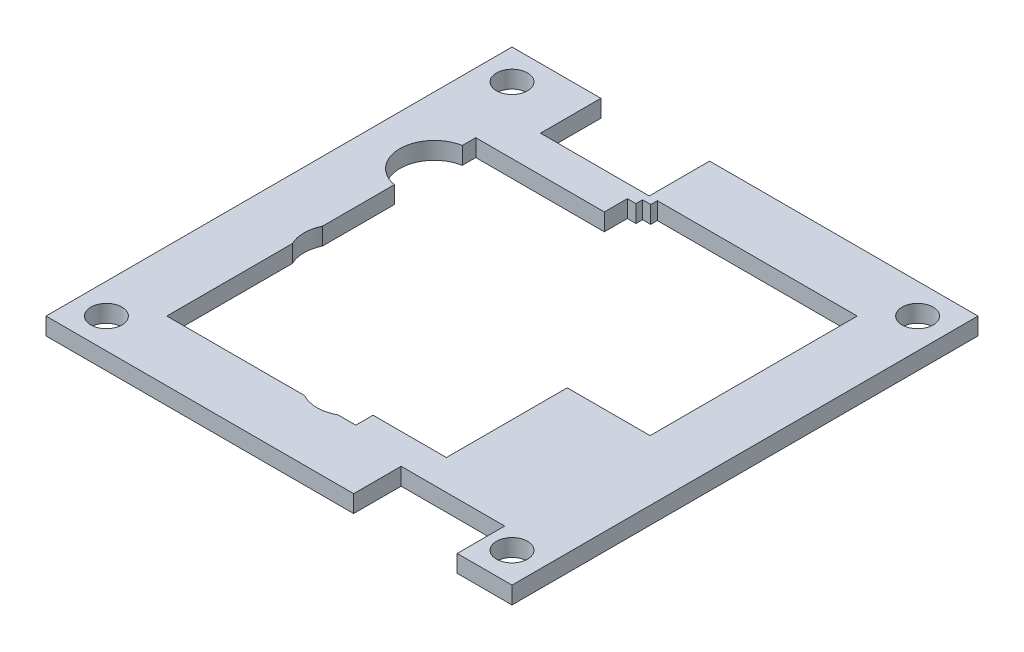
ISO-10303-21;
HEADER;
FILE_DESCRIPTION(('STEP AP214'),'2;1');
FILE_NAME('part.step','',(''),(''),'','','');
FILE_SCHEMA(('AUTOMOTIVE_DESIGN { 1 0 10303 214 1 1 1 1 }'));
ENDSEC;
DATA;
#1=APPLICATION_CONTEXT('core data for automotive mechanical design processes');
#2=APPLICATION_PROTOCOL_DEFINITION('international standard','automotive_design',2000,#1);
#3=PRODUCT_CONTEXT('',#1,'mechanical');
#4=PRODUCT('Part','Part','',(#3));
#5=PRODUCT_RELATED_PRODUCT_CATEGORY('part','',(#4));
#6=PRODUCT_DEFINITION_FORMATION('','',#4);
#7=PRODUCT_DEFINITION_CONTEXT('part definition',#1,'design');
#8=PRODUCT_DEFINITION('design','',#6,#7);
#9=PRODUCT_DEFINITION_SHAPE('','',#8);
#10=(LENGTH_UNIT() NAMED_UNIT(*) SI_UNIT(.MILLI.,.METRE.));
#11=(NAMED_UNIT(*) PLANE_ANGLE_UNIT() SI_UNIT($,.RADIAN.));
#12=(NAMED_UNIT(*) SI_UNIT($,.STERADIAN.) SOLID_ANGLE_UNIT());
#13=UNCERTAINTY_MEASURE_WITH_UNIT(LENGTH_MEASURE(1.E-05),#10,'distance_accuracy_value','');
#14=(GEOMETRIC_REPRESENTATION_CONTEXT(3) GLOBAL_UNCERTAINTY_ASSIGNED_CONTEXT((#13)) GLOBAL_UNIT_ASSIGNED_CONTEXT((#10,
#11,#12)) REPRESENTATION_CONTEXT('',''));
#15=CARTESIAN_POINT('',(0.,0.,0.));
#16=DIRECTION('',(0.,0.,1.));
#17=DIRECTION('',(1.,0.,0.));
#18=AXIS2_PLACEMENT_3D('',#15,#16,#17);
#19=CARTESIAN_POINT('',(0.,2.,-20.));
#20=DIRECTION('',(0.,0.,-1.));
#21=DIRECTION('',(-1.,0.,0.));
#22=AXIS2_PLACEMENT_3D('',#19,#20,#21);
#23=PLANE('',#22);
#24=DIRECTION('',(1.,0.,0.));
#25=VECTOR('',#24,1.);
#26=CARTESIAN_POINT('',(0.,0.,-20.));
#27=LINE('',#26,#25);
#28=CARTESIAN_POINT('',(-16.7,0.,-20.));
#29=VERTEX_POINT('',#28);
#30=CARTESIAN_POINT('',(-4.1,0.,-20.));
#31=VERTEX_POINT('',#30);
#32=EDGE_CURVE('E391',#29,#31,#27,.T.);
#33=ORIENTED_EDGE('',*,*,#32,.F.);
#34=DIRECTION('',(0.,-1.,0.));
#35=VECTOR('',#34,1.);
#36=CARTESIAN_POINT('',(-16.7,2.,-20.));
#37=LINE('',#36,#35);
#38=CARTESIAN_POINT('',(-16.7,2.,-20.));
#39=VERTEX_POINT('',#38);
#40=EDGE_CURVE('E11',#39,#29,#37,.T.);
#41=ORIENTED_EDGE('',*,*,#40,.F.);
#42=DIRECTION('',(1.,0.,0.));
#43=VECTOR('',#42,1.);
#44=CARTESIAN_POINT('',(0.,2.,-20.));
#45=LINE('',#44,#43);
#46=CARTESIAN_POINT('',(-4.1,2.,-20.));
#47=VERTEX_POINT('',#46);
#48=EDGE_CURVE('E473',#39,#47,#45,.T.);
#49=ORIENTED_EDGE('',*,*,#48,.T.);
#50=DIRECTION('',(0.,-1.,0.));
#51=VECTOR('',#50,1.);
#52=CARTESIAN_POINT('',(-4.1,2.,-20.));
#53=LINE('',#52,#51);
#54=EDGE_CURVE('E54',#47,#31,#53,.T.);
#55=ORIENTED_EDGE('',*,*,#54,.T.);
#56=EDGE_LOOP('',(#33,#41,#49,#55));
#57=FACE_BOUND('',#56,.T.);
#58=ADVANCED_FACE('F35',(#57),#23,.T.);
#59=CARTESIAN_POINT('',(-16.7,2.,0.));
#60=DIRECTION('',(-1.,0.,0.));
#61=DIRECTION('',(0.,0.,1.));
#62=AXIS2_PLACEMENT_3D('',#59,#60,#61);
#63=PLANE('',#62);
#64=DIRECTION('',(0.,0.,-1.));
#65=VECTOR('',#64,1.);
#66=CARTESIAN_POINT('',(-16.7,0.,0.));
#67=LINE('',#66,#65);
#68=CARTESIAN_POINT('',(-16.7,0.,-27.));
#69=VERTEX_POINT('',#68);
#70=EDGE_CURVE('E388',#29,#69,#67,.T.);
#71=ORIENTED_EDGE('',*,*,#70,.T.);
#72=DIRECTION('',(0.,-1.,0.));
#73=VECTOR('',#72,1.);
#74=CARTESIAN_POINT('',(-16.7,2.,-27.));
#75=LINE('',#74,#73);
#76=CARTESIAN_POINT('',(-16.7,2.,-27.));
#77=VERTEX_POINT('',#76);
#78=EDGE_CURVE('E45',#77,#69,#75,.T.);
#79=ORIENTED_EDGE('',*,*,#78,.F.);
#80=DIRECTION('',(0.,0.,-1.));
#81=VECTOR('',#80,1.);
#82=CARTESIAN_POINT('',(-16.7,2.,0.));
#83=LINE('',#82,#81);
#84=EDGE_CURVE('E470',#39,#77,#83,.T.);
#85=ORIENTED_EDGE('',*,*,#84,.F.);
#86=ORIENTED_EDGE('',*,*,#40,.T.);
#87=EDGE_LOOP('',(#71,#79,#85,#86));
#88=FACE_BOUND('',#87,.T.);
#89=ADVANCED_FACE('F570',(#88),#63,.F.);
#90=CARTESIAN_POINT('',(0.,2.,-27.));
#91=DIRECTION('',(0.,0.,1.));
#92=DIRECTION('',(1.,0.,0.));
#93=AXIS2_PLACEMENT_3D('',#90,#91,#92);
#94=PLANE('',#93);
#95=DIRECTION('',(-1.,0.,0.));
#96=VECTOR('',#95,1.);
#97=CARTESIAN_POINT('',(0.,0.,-27.));
#98=LINE('',#97,#96);
#99=CARTESIAN_POINT('',(-27.,0.,-27.));
#100=VERTEX_POINT('',#99);
#101=EDGE_CURVE('E385',#69,#100,#98,.T.);
#102=ORIENTED_EDGE('',*,*,#101,.T.);
#103=DIRECTION('',(0.,-1.,0.));
#104=VECTOR('',#103,1.);
#105=CARTESIAN_POINT('',(-27.,2.,-27.));
#106=LINE('',#105,#104);
#107=CARTESIAN_POINT('',(-27.,2.,-27.));
#108=VERTEX_POINT('',#107);
#109=EDGE_CURVE('E293',#108,#100,#106,.T.);
#110=ORIENTED_EDGE('',*,*,#109,.F.);
#111=DIRECTION('',(-1.,0.,0.));
#112=VECTOR('',#111,1.);
#113=CARTESIAN_POINT('',(0.,2.,-27.));
#114=LINE('',#113,#112);
#115=EDGE_CURVE('E467',#77,#108,#114,.T.);
#116=ORIENTED_EDGE('',*,*,#115,.F.);
#117=ORIENTED_EDGE('',*,*,#78,.T.);
#118=EDGE_LOOP('',(#102,#110,#116,#117));
#119=FACE_BOUND('',#118,.T.);
#120=ADVANCED_FACE('F575',(#119),#94,.F.);
#121=CARTESIAN_POINT('',(-27.,2.,0.));
#122=DIRECTION('',(1.,0.,0.));
#123=DIRECTION('',(0.,0.,-1.));
#124=AXIS2_PLACEMENT_3D('',#121,#122,#123);
#125=PLANE('',#124);
#126=DIRECTION('',(0.,0.,1.));
#127=VECTOR('',#126,1.);
#128=CARTESIAN_POINT('',(-27.,0.,0.));
#129=LINE('',#128,#127);
#130=CARTESIAN_POINT('',(-27.,0.,27.));
#131=VERTEX_POINT('',#130);
#132=EDGE_CURVE('E382',#100,#131,#129,.T.);
#133=ORIENTED_EDGE('',*,*,#132,.T.);
#134=DIRECTION('',(0.,-1.,0.));
#135=VECTOR('',#134,1.);
#136=CARTESIAN_POINT('',(-27.,2.,27.));
#137=LINE('',#136,#135);
#138=CARTESIAN_POINT('',(-27.,2.,27.));
#139=VERTEX_POINT('',#138);
#140=EDGE_CURVE('E290',#139,#131,#137,.T.);
#141=ORIENTED_EDGE('',*,*,#140,.F.);
#142=DIRECTION('',(0.,0.,1.));
#143=VECTOR('',#142,1.);
#144=CARTESIAN_POINT('',(-27.,2.,0.));
#145=LINE('',#144,#143);
#146=EDGE_CURVE('E464',#108,#139,#145,.T.);
#147=ORIENTED_EDGE('',*,*,#146,.F.);
#148=ORIENTED_EDGE('',*,*,#109,.T.);
#149=EDGE_LOOP('',(#133,#141,#147,#148));
#150=FACE_BOUND('',#149,.T.);
#151=ADVANCED_FACE('F725',(#150),#125,.F.);
#152=CARTESIAN_POINT('',(0.,2.,27.));
#153=DIRECTION('',(0.,0.,-1.));
#154=DIRECTION('',(-1.,0.,0.));
#155=AXIS2_PLACEMENT_3D('',#152,#153,#154);
#156=PLANE('',#155);
#157=DIRECTION('',(1.,0.,0.));
#158=VECTOR('',#157,1.);
#159=CARTESIAN_POINT('',(0.,0.,27.));
#160=LINE('',#159,#158);
#161=CARTESIAN_POINT('',(8.65,0.,27.));
#162=VERTEX_POINT('',#161);
#163=EDGE_CURVE('E379',#131,#162,#160,.T.);
#164=ORIENTED_EDGE('',*,*,#163,.T.);
#165=DIRECTION('',(0.,-1.,0.));
#166=VECTOR('',#165,1.);
#167=CARTESIAN_POINT('',(8.65,2.,27.));
#168=LINE('',#167,#166);
#169=CARTESIAN_POINT('',(8.65,2.,27.));
#170=VERTEX_POINT('',#169);
#171=EDGE_CURVE('E288',#170,#162,#168,.T.);
#172=ORIENTED_EDGE('',*,*,#171,.F.);
#173=DIRECTION('',(1.,0.,0.));
#174=VECTOR('',#173,1.);
#175=CARTESIAN_POINT('',(0.,2.,27.));
#176=LINE('',#175,#174);
#177=EDGE_CURVE('E462',#139,#170,#176,.T.);
#178=ORIENTED_EDGE('',*,*,#177,.F.);
#179=ORIENTED_EDGE('',*,*,#140,.T.);
#180=EDGE_LOOP('',(#164,#172,#178,#179));
#181=FACE_BOUND('',#180,.T.);
#182=ADVANCED_FACE('F717',(#181),#156,.F.);
#183=CARTESIAN_POINT('',(8.65,2.,0.));
#184=DIRECTION('',(1.,0.,0.));
#185=DIRECTION('',(0.,0.,-1.));
#186=AXIS2_PLACEMENT_3D('',#183,#184,#185);
#187=PLANE('',#186);
#188=DIRECTION('',(0.,0.,1.));
#189=VECTOR('',#188,1.);
#190=CARTESIAN_POINT('',(8.65,0.,0.));
#191=LINE('',#190,#189);
#192=CARTESIAN_POINT('',(8.65,0.,21.5));
#193=VERTEX_POINT('',#192);
#194=EDGE_CURVE('E376',#193,#162,#191,.T.);
#195=ORIENTED_EDGE('',*,*,#194,.F.);
#196=DIRECTION('',(0.,-1.,0.));
#197=VECTOR('',#196,1.);
#198=CARTESIAN_POINT('',(8.65,2.,21.5));
#199=LINE('',#198,#197);
#200=CARTESIAN_POINT('',(8.65,2.,21.5));
#201=VERTEX_POINT('',#200);
#202=EDGE_CURVE('E286',#201,#193,#199,.T.);
#203=ORIENTED_EDGE('',*,*,#202,.F.);
#204=DIRECTION('',(0.,0.,1.));
#205=VECTOR('',#204,1.);
#206=CARTESIAN_POINT('',(8.65,2.,0.));
#207=LINE('',#206,#205);
#208=EDGE_CURVE('E459',#201,#170,#207,.T.);
#209=ORIENTED_EDGE('',*,*,#208,.T.);
#210=ORIENTED_EDGE('',*,*,#171,.T.);
#211=EDGE_LOOP('',(#195,#203,#209,#210));
#212=FACE_BOUND('',#211,.T.);
#213=ADVANCED_FACE('F709',(#212),#187,.T.);
#214=CARTESIAN_POINT('',(0.,2.,21.5));
#215=DIRECTION('',(0.,0.,-1.));
#216=DIRECTION('',(-1.,0.,0.));
#217=AXIS2_PLACEMENT_3D('',#214,#215,#216);
#218=PLANE('',#217);
#219=DIRECTION('',(1.,0.,0.));
#220=VECTOR('',#219,1.);
#221=CARTESIAN_POINT('',(0.,0.,21.5));
#222=LINE('',#221,#220);
#223=CARTESIAN_POINT('',(20.65,0.,21.5));
#224=VERTEX_POINT('',#223);
#225=EDGE_CURVE('E373',#193,#224,#222,.T.);
#226=ORIENTED_EDGE('',*,*,#225,.T.);
#227=DIRECTION('',(0.,-1.,0.));
#228=VECTOR('',#227,1.);
#229=CARTESIAN_POINT('',(20.65,2.,21.5));
#230=LINE('',#229,#228);
#231=CARTESIAN_POINT('',(20.65,2.,21.5));
#232=VERTEX_POINT('',#231);
#233=EDGE_CURVE('E283',#232,#224,#230,.T.);
#234=ORIENTED_EDGE('',*,*,#233,.F.);
#235=DIRECTION('',(1.,0.,0.));
#236=VECTOR('',#235,1.);
#237=CARTESIAN_POINT('',(0.,2.,21.5));
#238=LINE('',#237,#236);
#239=EDGE_CURVE('E456',#201,#232,#238,.T.);
#240=ORIENTED_EDGE('',*,*,#239,.F.);
#241=ORIENTED_EDGE('',*,*,#202,.T.);
#242=EDGE_LOOP('',(#226,#234,#240,#241));
#243=FACE_BOUND('',#242,.T.);
#244=ADVANCED_FACE('F701',(#243),#218,.F.);
#245=CARTESIAN_POINT('',(20.65,2.,0.));
#246=DIRECTION('',(1.,0.,0.));
#247=DIRECTION('',(0.,0.,-1.));
#248=AXIS2_PLACEMENT_3D('',#245,#246,#247);
#249=PLANE('',#248);
#250=DIRECTION('',(0.,0.,1.));
#251=VECTOR('',#250,1.);
#252=CARTESIAN_POINT('',(20.65,0.,0.));
#253=LINE('',#252,#251);
#254=CARTESIAN_POINT('',(20.65,0.,27.));
#255=VERTEX_POINT('',#254);
#256=EDGE_CURVE('E370',#224,#255,#253,.T.);
#257=ORIENTED_EDGE('',*,*,#256,.T.);
#258=DIRECTION('',(0.,-1.,0.));
#259=VECTOR('',#258,1.);
#260=CARTESIAN_POINT('',(20.65,2.,27.));
#261=LINE('',#260,#259);
#262=CARTESIAN_POINT('',(20.65,2.,27.));
#263=VERTEX_POINT('',#262);
#264=EDGE_CURVE('E276',#263,#255,#261,.T.);
#265=ORIENTED_EDGE('',*,*,#264,.F.);
#266=DIRECTION('',(0.,0.,1.));
#267=VECTOR('',#266,1.);
#268=CARTESIAN_POINT('',(20.65,2.,0.));
#269=LINE('',#268,#267);
#270=EDGE_CURVE('E454',#232,#263,#269,.T.);
#271=ORIENTED_EDGE('',*,*,#270,.F.);
#272=ORIENTED_EDGE('',*,*,#233,.T.);
#273=EDGE_LOOP('',(#257,#265,#271,#272));
#274=FACE_BOUND('',#273,.T.);
#275=ADVANCED_FACE('F693',(#274),#249,.F.);
#276=CARTESIAN_POINT('',(0.,2.,27.));
#277=DIRECTION('',(0.,0.,-1.));
#278=DIRECTION('',(-1.,0.,0.));
#279=AXIS2_PLACEMENT_3D('',#276,#277,#278);
#280=PLANE('',#279);
#281=DIRECTION('',(1.,0.,0.));
#282=VECTOR('',#281,1.);
#283=CARTESIAN_POINT('',(0.,0.,27.));
#284=LINE('',#283,#282);
#285=CARTESIAN_POINT('',(27.,0.,27.));
#286=VERTEX_POINT('',#285);
#287=EDGE_CURVE('E367',#255,#286,#284,.T.);
#288=ORIENTED_EDGE('',*,*,#287,.T.);
#289=DIRECTION('',(0.,-1.,0.));
#290=VECTOR('',#289,1.);
#291=CARTESIAN_POINT('',(27.,2.,27.));
#292=LINE('',#291,#290);
#293=CARTESIAN_POINT('',(27.,2.,27.));
#294=VERTEX_POINT('',#293);
#295=EDGE_CURVE('E274',#294,#286,#292,.T.);
#296=ORIENTED_EDGE('',*,*,#295,.F.);
#297=DIRECTION('',(1.,0.,0.));
#298=VECTOR('',#297,1.);
#299=CARTESIAN_POINT('',(0.,2.,27.));
#300=LINE('',#299,#298);
#301=EDGE_CURVE('E267',#263,#294,#300,.T.);
#302=ORIENTED_EDGE('',*,*,#301,.F.);
#303=ORIENTED_EDGE('',*,*,#264,.T.);
#304=EDGE_LOOP('',(#288,#296,#302,#303));
#305=FACE_BOUND('',#304,.T.);
#306=ADVANCED_FACE('F686',(#305),#280,.F.);
#307=CARTESIAN_POINT('',(27.,2.,0.));
#308=DIRECTION('',(-1.,0.,0.));
#309=DIRECTION('',(0.,0.,1.));
#310=AXIS2_PLACEMENT_3D('',#307,#308,#309);
#311=PLANE('',#310);
#312=DIRECTION('',(0.,0.,-1.));
#313=VECTOR('',#312,1.);
#314=CARTESIAN_POINT('',(27.,0.,0.));
#315=LINE('',#314,#313);
#316=CARTESIAN_POINT('',(27.,0.,-27.));
#317=VERTEX_POINT('',#316);
#318=EDGE_CURVE('E273',#286,#317,#315,.T.);
#319=ORIENTED_EDGE('',*,*,#318,.T.);
#320=DIRECTION('',(0.,-1.,0.));
#321=VECTOR('',#320,1.);
#322=CARTESIAN_POINT('',(27.,2.,-27.));
#323=LINE('',#322,#321);
#324=CARTESIAN_POINT('',(27.,2.,-27.));
#325=VERTEX_POINT('',#324);
#326=EDGE_CURVE('E255',#325,#317,#323,.T.);
#327=ORIENTED_EDGE('',*,*,#326,.F.);
#328=DIRECTION('',(0.,0.,-1.));
#329=VECTOR('',#328,1.);
#330=CARTESIAN_POINT('',(27.,2.,0.));
#331=LINE('',#330,#329);
#332=EDGE_CURVE('E260',#294,#325,#331,.T.);
#333=ORIENTED_EDGE('',*,*,#332,.F.);
#334=ORIENTED_EDGE('',*,*,#295,.T.);
#335=EDGE_LOOP('',(#319,#327,#333,#334));
#336=FACE_BOUND('',#335,.T.);
#337=ADVANCED_FACE('F272',(#336),#311,.F.);
#338=CARTESIAN_POINT('',(0.,2.,-27.));
#339=DIRECTION('',(0.,0.,1.));
#340=DIRECTION('',(1.,0.,0.));
#341=AXIS2_PLACEMENT_3D('',#338,#339,#340);
#342=PLANE('',#341);
#343=DIRECTION('',(-1.,0.,0.));
#344=VECTOR('',#343,1.);
#345=CARTESIAN_POINT('',(0.,0.,-27.));
#346=LINE('',#345,#344);
#347=CARTESIAN_POINT('',(-4.1,0.,-27.));
#348=VERTEX_POINT('',#347);
#349=EDGE_CURVE('E364',#317,#348,#346,.T.);
#350=ORIENTED_EDGE('',*,*,#349,.T.);
#351=DIRECTION('',(0.,-1.,0.));
#352=VECTOR('',#351,1.);
#353=CARTESIAN_POINT('',(-4.1,2.,-27.));
#354=LINE('',#353,#352);
#355=CARTESIAN_POINT('',(-4.1,2.,-27.));
#356=VERTEX_POINT('',#355);
#357=EDGE_CURVE('E152',#356,#348,#354,.T.);
#358=ORIENTED_EDGE('',*,*,#357,.F.);
#359=DIRECTION('',(-1.,0.,0.));
#360=VECTOR('',#359,1.);
#361=CARTESIAN_POINT('',(0.,2.,-27.));
#362=LINE('',#361,#360);
#363=EDGE_CURVE('E251',#325,#356,#362,.T.);
#364=ORIENTED_EDGE('',*,*,#363,.F.);
#365=ORIENTED_EDGE('',*,*,#326,.T.);
#366=EDGE_LOOP('',(#350,#358,#364,#365));
#367=FACE_BOUND('',#366,.T.);
#368=ADVANCED_FACE('F253',(#367),#342,.F.);
#369=CARTESIAN_POINT('',(-20.,2.,0.));
#370=DIRECTION('',(1.,0.,0.));
#371=DIRECTION('',(0.,0.,-1.));
#372=AXIS2_PLACEMENT_3D('',#369,#370,#371);
#373=PLANE('',#372);
#374=DIRECTION('',(0.,0.,1.));
#375=VECTOR('',#374,1.);
#376=CARTESIAN_POINT('',(-20.,0.,0.));
#377=LINE('',#376,#375);
#378=CARTESIAN_POINT('',(-20.,0.,-15.8));
#379=VERTEX_POINT('',#378);
#380=CARTESIAN_POINT('',(-20.,0.,-14.238273733503));
#381=VERTEX_POINT('',#380);
#382=EDGE_CURVE('E438',#379,#381,#377,.T.);
#383=ORIENTED_EDGE('',*,*,#382,.F.);
#384=DIRECTION('',(0.,-1.,0.));
#385=VECTOR('',#384,1.);
#386=CARTESIAN_POINT('',(-20.,2.,-15.8));
#387=LINE('',#386,#385);
#388=CARTESIAN_POINT('',(-20.,2.,-15.8));
#389=VERTEX_POINT('',#388);
#390=EDGE_CURVE('E39',#389,#379,#387,.T.);
#391=ORIENTED_EDGE('',*,*,#390,.F.);
#392=DIRECTION('',(0.,0.,1.));
#393=VECTOR('',#392,1.);
#394=CARTESIAN_POINT('',(-20.,2.,0.));
#395=LINE('',#394,#393);
#396=CARTESIAN_POINT('',(-20.,2.,-14.238273733503));
#397=VERTEX_POINT('',#396);
#398=EDGE_CURVE('E351',#389,#397,#395,.T.);
#399=ORIENTED_EDGE('',*,*,#398,.T.);
#400=DIRECTION('',(0.,-1.,0.));
#401=VECTOR('',#400,1.);
#402=CARTESIAN_POINT('',(-20.,2.,-14.238273733503));
#403=LINE('',#402,#401);
#404=EDGE_CURVE('E298',#397,#381,#403,.T.);
#405=ORIENTED_EDGE('',*,*,#404,.T.);
#406=EDGE_LOOP('',(#383,#391,#399,#405));
#407=FACE_BOUND('',#406,.T.);
#408=ADVANCED_FACE('F557',(#407),#373,.T.);
#409=CARTESIAN_POINT('',(0.,2.,-15.8));
#410=DIRECTION('',(0.,0.,-1.));
#411=DIRECTION('',(-1.,0.,0.));
#412=AXIS2_PLACEMENT_3D('',#409,#410,#411);
#413=PLANE('',#412);
#414=DIRECTION('',(1.,0.,0.));
#415=VECTOR('',#414,1.);
#416=CARTESIAN_POINT('',(0.,0.,-15.8));
#417=LINE('',#416,#415);
#418=CARTESIAN_POINT('',(-5.1,0.,-15.8));
#419=VERTEX_POINT('',#418);
#420=EDGE_CURVE('E436',#379,#419,#417,.T.);
#421=ORIENTED_EDGE('',*,*,#420,.T.);
#422=DIRECTION('',(0.,-1.,0.));
#423=VECTOR('',#422,1.);
#424=CARTESIAN_POINT('',(-5.1,2.,-15.8));
#425=LINE('',#424,#423);
#426=CARTESIAN_POINT('',(-5.1,2.,-15.8));
#427=VERTEX_POINT('',#426);
#428=EDGE_CURVE('E339',#427,#419,#425,.T.);
#429=ORIENTED_EDGE('',*,*,#428,.F.);
#430=DIRECTION('',(1.,0.,0.));
#431=VECTOR('',#430,1.);
#432=CARTESIAN_POINT('',(0.,2.,-15.8));
#433=LINE('',#432,#431);
#434=EDGE_CURVE('E517',#389,#427,#433,.T.);
#435=ORIENTED_EDGE('',*,*,#434,.F.);
#436=ORIENTED_EDGE('',*,*,#390,.T.);
#437=EDGE_LOOP('',(#421,#429,#435,#436));
#438=FACE_BOUND('',#437,.T.);
#439=ADVANCED_FACE('F37',(#438),#413,.F.);
#440=CARTESIAN_POINT('',(-5.1,2.,0.));
#441=DIRECTION('',(-1.,0.,0.));
#442=DIRECTION('',(0.,0.,1.));
#443=AXIS2_PLACEMENT_3D('',#440,#441,#442);
#444=PLANE('',#443);
#445=DIRECTION('',(0.,0.,-1.));
#446=VECTOR('',#445,1.);
#447=CARTESIAN_POINT('',(-5.1,0.,0.));
#448=LINE('',#447,#446);
#449=CARTESIAN_POINT('',(-5.1,0.,-18.4633439008393));
#450=VERTEX_POINT('',#449);
#451=EDGE_CURVE('E434',#419,#450,#448,.T.);
#452=ORIENTED_EDGE('',*,*,#451,.T.);
#453=DIRECTION('',(0.,-1.,0.));
#454=VECTOR('',#453,1.);
#455=CARTESIAN_POINT('',(-5.1,2.,-18.4633439008393));
#456=LINE('',#455,#454);
#457=CARTESIAN_POINT('',(-5.1,2.,-18.4633439008393));
#458=VERTEX_POINT('',#457);
#459=EDGE_CURVE('E337',#458,#450,#456,.T.);
#460=ORIENTED_EDGE('',*,*,#459,.F.);
#461=DIRECTION('',(0.,0.,-1.));
#462=VECTOR('',#461,1.);
#463=CARTESIAN_POINT('',(-5.1,2.,0.));
#464=LINE('',#463,#462);
#465=EDGE_CURVE('E515',#427,#458,#464,.T.);
#466=ORIENTED_EDGE('',*,*,#465,.F.);
#467=ORIENTED_EDGE('',*,*,#428,.T.);
#468=EDGE_LOOP('',(#452,#460,#466,#467));
#469=FACE_BOUND('',#468,.T.);
#470=ADVANCED_FACE('F593',(#469),#444,.F.);
#471=CARTESIAN_POINT('',(0.,2.,-18.4633439008393));
#472=DIRECTION('',(0.,0.,-1.));
#473=DIRECTION('',(-1.,0.,0.));
#474=AXIS2_PLACEMENT_3D('',#471,#472,#473);
#475=PLANE('',#474);
#476=DIRECTION('',(1.,0.,0.));
#477=VECTOR('',#476,1.);
#478=CARTESIAN_POINT('',(0.,0.,-18.4633439008393));
#479=LINE('',#478,#477);
#480=CARTESIAN_POINT('',(-4.1,0.,-18.4633439008393));
#481=VERTEX_POINT('',#480);
#482=EDGE_CURVE('E432',#450,#481,#479,.T.);
#483=ORIENTED_EDGE('',*,*,#482,.T.);
#484=DIRECTION('',(0.,-1.,0.));
#485=VECTOR('',#484,1.);
#486=CARTESIAN_POINT('',(-4.1,2.,-18.4633439008393));
#487=LINE('',#486,#485);
#488=CARTESIAN_POINT('',(-4.1,2.,-18.4633439008393));
#489=VERTEX_POINT('',#488);
#490=EDGE_CURVE('E334',#489,#481,#487,.T.);
#491=ORIENTED_EDGE('',*,*,#490,.F.);
#492=DIRECTION('',(1.,0.,0.));
#493=VECTOR('',#492,1.);
#494=CARTESIAN_POINT('',(0.,2.,-18.4633439008393));
#495=LINE('',#494,#493);
#496=EDGE_CURVE('E513',#458,#489,#495,.T.);
#497=ORIENTED_EDGE('',*,*,#496,.F.);
#498=ORIENTED_EDGE('',*,*,#459,.T.);
#499=EDGE_LOOP('',(#483,#491,#497,#498));
#500=FACE_BOUND('',#499,.T.);
#501=ADVANCED_FACE('F598',(#500),#475,.F.);
#502=CARTESIAN_POINT('',(-4.10000000000001,2.,0.));
#503=DIRECTION('',(-1.,0.,0.));
#504=DIRECTION('',(0.,0.,1.));
#505=AXIS2_PLACEMENT_3D('',#502,#503,#504);
#506=PLANE('',#505);
#507=DIRECTION('',(0.,0.,-1.));
#508=VECTOR('',#507,1.);
#509=CARTESIAN_POINT('',(-4.10000000000001,0.,0.));
#510=LINE('',#509,#508);
#511=CARTESIAN_POINT('',(-4.1,0.,-19.2316719504197));
#512=VERTEX_POINT('',#511);
#513=EDGE_CURVE('E430',#481,#512,#510,.T.);
#514=ORIENTED_EDGE('',*,*,#513,.T.);
#515=DIRECTION('',(0.,-1.,0.));
#516=VECTOR('',#515,1.);
#517=CARTESIAN_POINT('',(-4.1,2.,-19.2316719504197));
#518=LINE('',#517,#516);
#519=CARTESIAN_POINT('',(-4.1,2.,-19.2316719504197));
#520=VERTEX_POINT('',#519);
#521=EDGE_CURVE('E331',#520,#512,#518,.T.);
#522=ORIENTED_EDGE('',*,*,#521,.F.);
#523=DIRECTION('',(0.,0.,-1.));
#524=VECTOR('',#523,1.);
#525=CARTESIAN_POINT('',(-4.10000000000001,2.,0.));
#526=LINE('',#525,#524);
#527=EDGE_CURVE('E511',#489,#520,#526,.T.);
#528=ORIENTED_EDGE('',*,*,#527,.F.);
#529=ORIENTED_EDGE('',*,*,#490,.T.);
#530=EDGE_LOOP('',(#514,#522,#528,#529));
#531=FACE_BOUND('',#530,.T.);
#532=ADVANCED_FACE('F604',(#531),#506,.F.);
#533=CARTESIAN_POINT('',(0.,2.,-19.2316719504197));
#534=DIRECTION('',(0.,0.,-1.));
#535=DIRECTION('',(-1.,0.,0.));
#536=AXIS2_PLACEMENT_3D('',#533,#534,#535);
#537=PLANE('',#536);
#538=DIRECTION('',(1.,0.,0.));
#539=VECTOR('',#538,1.);
#540=CARTESIAN_POINT('',(0.,0.,-19.2316719504197));
#541=LINE('',#540,#539);
#542=CARTESIAN_POINT('',(-3.15514661878485,0.,-19.2316719504197));
#543=VERTEX_POINT('',#542);
#544=EDGE_CURVE('E428',#512,#543,#541,.T.);
#545=ORIENTED_EDGE('',*,*,#544,.T.);
#546=DIRECTION('',(0.,-1.,0.));
#547=VECTOR('',#546,1.);
#548=CARTESIAN_POINT('',(-3.15514661878485,2.,-19.2316719504197));
#549=LINE('',#548,#547);
#550=CARTESIAN_POINT('',(-3.15514661878485,2.,-19.2316719504197));
#551=VERTEX_POINT('',#550);
#552=EDGE_CURVE('E328',#551,#543,#549,.T.);
#553=ORIENTED_EDGE('',*,*,#552,.F.);
#554=DIRECTION('',(1.,0.,0.));
#555=VECTOR('',#554,1.);
#556=CARTESIAN_POINT('',(0.,2.,-19.2316719504197));
#557=LINE('',#556,#555);
#558=EDGE_CURVE('E509',#520,#551,#557,.T.);
#559=ORIENTED_EDGE('',*,*,#558,.F.);
#560=ORIENTED_EDGE('',*,*,#521,.T.);
#561=EDGE_LOOP('',(#545,#553,#559,#560));
#562=FACE_BOUND('',#561,.T.);
#563=ADVANCED_FACE('F608',(#562),#537,.F.);
#564=CARTESIAN_POINT('',(-3.15514661878484,2.,0.));
#565=DIRECTION('',(-1.,0.,0.));
#566=DIRECTION('',(0.,0.,1.));
#567=AXIS2_PLACEMENT_3D('',#564,#565,#566);
#568=PLANE('',#567);
#569=DIRECTION('',(0.,0.,-1.));
#570=VECTOR('',#569,1.);
#571=CARTESIAN_POINT('',(-3.15514661878484,0.,0.));
#572=LINE('',#571,#570);
#573=CARTESIAN_POINT('',(-3.15514661878485,0.,-20.));
#574=VERTEX_POINT('',#573);
#575=EDGE_CURVE('E426',#543,#574,#572,.T.);
#576=ORIENTED_EDGE('',*,*,#575,.T.);
#577=DIRECTION('',(0.,-1.,0.));
#578=VECTOR('',#577,1.);
#579=CARTESIAN_POINT('',(-3.15514661878485,2.,-20.));
#580=LINE('',#579,#578);
#581=CARTESIAN_POINT('',(-3.15514661878485,2.,-20.));
#582=VERTEX_POINT('',#581);
#583=EDGE_CURVE('E325',#582,#574,#580,.T.);
#584=ORIENTED_EDGE('',*,*,#583,.F.);
#585=DIRECTION('',(0.,0.,-1.));
#586=VECTOR('',#585,1.);
#587=CARTESIAN_POINT('',(-3.15514661878484,2.,0.));
#588=LINE('',#587,#586);
#589=EDGE_CURVE('E507',#551,#582,#588,.T.);
#590=ORIENTED_EDGE('',*,*,#589,.F.);
#591=ORIENTED_EDGE('',*,*,#552,.T.);
#592=EDGE_LOOP('',(#576,#584,#590,#591));
#593=FACE_BOUND('',#592,.T.);
#594=ADVANCED_FACE('F613',(#593),#568,.F.);
#595=CARTESIAN_POINT('',(0.,2.,-20.));
#596=DIRECTION('',(0.,0.,-1.));
#597=DIRECTION('',(-1.,0.,0.));
#598=AXIS2_PLACEMENT_3D('',#595,#596,#597);
#599=PLANE('',#598);
#600=DIRECTION('',(1.,0.,0.));
#601=VECTOR('',#600,1.);
#602=CARTESIAN_POINT('',(0.,0.,-20.));
#603=LINE('',#602,#601);
#604=CARTESIAN_POINT('',(20.,0.,-20.));
#605=VERTEX_POINT('',#604);
#606=EDGE_CURVE('E423',#574,#605,#603,.T.);
#607=ORIENTED_EDGE('',*,*,#606,.T.);
#608=DIRECTION('',(0.,-1.,0.));
#609=VECTOR('',#608,1.);
#610=CARTESIAN_POINT('',(20.,2.,-20.));
#611=LINE('',#610,#609);
#612=CARTESIAN_POINT('',(20.,2.,-20.));
#613=VERTEX_POINT('',#612);
#614=EDGE_CURVE('E323',#613,#605,#611,.T.);
#615=ORIENTED_EDGE('',*,*,#614,.F.);
#616=DIRECTION('',(1.,0.,0.));
#617=VECTOR('',#616,1.);
#618=CARTESIAN_POINT('',(0.,2.,-20.));
#619=LINE('',#618,#617);
#620=EDGE_CURVE('E505',#582,#613,#619,.T.);
#621=ORIENTED_EDGE('',*,*,#620,.F.);
#622=ORIENTED_EDGE('',*,*,#583,.T.);
#623=EDGE_LOOP('',(#607,#615,#621,#622));
#624=FACE_BOUND('',#623,.T.);
#625=ADVANCED_FACE('F619',(#624),#599,.F.);
#626=CARTESIAN_POINT('',(20.,2.,0.));
#627=DIRECTION('',(-1.,0.,0.));
#628=DIRECTION('',(0.,0.,1.));
#629=AXIS2_PLACEMENT_3D('',#626,#627,#628);
#630=PLANE('',#629);
#631=DIRECTION('',(0.,0.,-1.));
#632=VECTOR('',#631,1.);
#633=CARTESIAN_POINT('',(20.,0.,0.));
#634=LINE('',#633,#632);
#635=CARTESIAN_POINT('',(20.,0.,4.));
#636=VERTEX_POINT('',#635);
#637=EDGE_CURVE('E420',#636,#605,#634,.T.);
#638=ORIENTED_EDGE('',*,*,#637,.F.);
#639=DIRECTION('',(0.,-1.,0.));
#640=VECTOR('',#639,1.);
#641=CARTESIAN_POINT('',(20.,2.,4.));
#642=LINE('',#641,#640);
#643=CARTESIAN_POINT('',(20.,2.,4.));
#644=VERTEX_POINT('',#643);
#645=EDGE_CURVE('E321',#644,#636,#642,.T.);
#646=ORIENTED_EDGE('',*,*,#645,.F.);
#647=DIRECTION('',(0.,0.,-1.));
#648=VECTOR('',#647,1.);
#649=CARTESIAN_POINT('',(20.,2.,0.));
#650=LINE('',#649,#648);
#651=EDGE_CURVE('E502',#644,#613,#650,.T.);
#652=ORIENTED_EDGE('',*,*,#651,.T.);
#653=ORIENTED_EDGE('',*,*,#614,.T.);
#654=EDGE_LOOP('',(#638,#646,#652,#653));
#655=FACE_BOUND('',#654,.T.);
#656=ADVANCED_FACE('F623',(#655),#630,.T.);
#657=CARTESIAN_POINT('',(0.,2.,4.));
#658=DIRECTION('',(0.,0.,-1.));
#659=DIRECTION('',(-1.,0.,0.));
#660=AXIS2_PLACEMENT_3D('',#657,#658,#659);
#661=PLANE('',#660);
#662=DIRECTION('',(1.,0.,0.));
#663=VECTOR('',#662,1.);
#664=CARTESIAN_POINT('',(0.,0.,4.));
#665=LINE('',#664,#663);
#666=CARTESIAN_POINT('',(10.4,0.,4.));
#667=VERTEX_POINT('',#666);
#668=EDGE_CURVE('E417',#667,#636,#665,.T.);
#669=ORIENTED_EDGE('',*,*,#668,.F.);
#670=DIRECTION('',(0.,-1.,0.));
#671=VECTOR('',#670,1.);
#672=CARTESIAN_POINT('',(10.4,2.,4.));
#673=LINE('',#672,#671);
#674=CARTESIAN_POINT('',(10.4,2.,4.));
#675=VERTEX_POINT('',#674);
#676=EDGE_CURVE('E319',#675,#667,#673,.T.);
#677=ORIENTED_EDGE('',*,*,#676,.F.);
#678=DIRECTION('',(1.,0.,0.));
#679=VECTOR('',#678,1.);
#680=CARTESIAN_POINT('',(0.,2.,4.));
#681=LINE('',#680,#679);
#682=EDGE_CURVE('E499',#675,#644,#681,.T.);
#683=ORIENTED_EDGE('',*,*,#682,.T.);
#684=ORIENTED_EDGE('',*,*,#645,.T.);
#685=EDGE_LOOP('',(#669,#677,#683,#684));
#686=FACE_BOUND('',#685,.T.);
#687=ADVANCED_FACE('F626',(#686),#661,.T.);
#688=CARTESIAN_POINT('',(10.4,2.,0.));
#689=DIRECTION('',(-1.,0.,0.));
#690=DIRECTION('',(0.,0.,1.));
#691=AXIS2_PLACEMENT_3D('',#688,#689,#690);
#692=PLANE('',#691);
#693=DIRECTION('',(0.,0.,-1.));
#694=VECTOR('',#693,1.);
#695=CARTESIAN_POINT('',(10.4,0.,0.));
#696=LINE('',#695,#694);
#697=CARTESIAN_POINT('',(10.4,0.,18.));
#698=VERTEX_POINT('',#697);
#699=EDGE_CURVE('E414',#698,#667,#696,.T.);
#700=ORIENTED_EDGE('',*,*,#699,.F.);
#701=DIRECTION('',(0.,-1.,0.));
#702=VECTOR('',#701,1.);
#703=CARTESIAN_POINT('',(10.4,2.,18.));
#704=LINE('',#703,#702);
#705=CARTESIAN_POINT('',(10.4,2.,18.));
#706=VERTEX_POINT('',#705);
#707=EDGE_CURVE('E317',#706,#698,#704,.T.);
#708=ORIENTED_EDGE('',*,*,#707,.F.);
#709=DIRECTION('',(0.,0.,-1.));
#710=VECTOR('',#709,1.);
#711=CARTESIAN_POINT('',(10.4,2.,0.));
#712=LINE('',#711,#710);
#713=EDGE_CURVE('E496',#706,#675,#712,.T.);
#714=ORIENTED_EDGE('',*,*,#713,.T.);
#715=ORIENTED_EDGE('',*,*,#676,.T.);
#716=EDGE_LOOP('',(#700,#708,#714,#715));
#717=FACE_BOUND('',#716,.T.);
#718=ADVANCED_FACE('F631',(#717),#692,.T.);
#719=CARTESIAN_POINT('',(0.,2.,18.));
#720=DIRECTION('',(0.,0.,-1.));
#721=DIRECTION('',(-1.,0.,0.));
#722=AXIS2_PLACEMENT_3D('',#719,#720,#721);
#723=PLANE('',#722);
#724=DIRECTION('',(1.,0.,0.));
#725=VECTOR('',#724,1.);
#726=CARTESIAN_POINT('',(0.,0.,18.));
#727=LINE('',#726,#725);
#728=CARTESIAN_POINT('',(1.9,0.,18.));
#729=VERTEX_POINT('',#728);
#730=EDGE_CURVE('E411',#729,#698,#727,.T.);
#731=ORIENTED_EDGE('',*,*,#730,.F.);
#732=DIRECTION('',(0.,-1.,0.));
#733=VECTOR('',#732,1.);
#734=CARTESIAN_POINT('',(1.9,2.,18.));
#735=LINE('',#734,#733);
#736=CARTESIAN_POINT('',(1.9,2.,18.));
#737=VERTEX_POINT('',#736);
#738=EDGE_CURVE('E315',#737,#729,#735,.T.);
#739=ORIENTED_EDGE('',*,*,#738,.F.);
#740=DIRECTION('',(1.,0.,0.));
#741=VECTOR('',#740,1.);
#742=CARTESIAN_POINT('',(0.,2.,18.));
#743=LINE('',#742,#741);
#744=EDGE_CURVE('E493',#737,#706,#743,.T.);
#745=ORIENTED_EDGE('',*,*,#744,.T.);
#746=ORIENTED_EDGE('',*,*,#707,.T.);
#747=EDGE_LOOP('',(#731,#739,#745,#746));
#748=FACE_BOUND('',#747,.T.);
#749=ADVANCED_FACE('F634',(#748),#723,.T.);
#750=CARTESIAN_POINT('',(1.9,2.,0.));
#751=DIRECTION('',(-1.,0.,0.));
#752=DIRECTION('',(0.,0.,1.));
#753=AXIS2_PLACEMENT_3D('',#750,#751,#752);
#754=PLANE('',#753);
#755=DIRECTION('',(0.,0.,-1.));
#756=VECTOR('',#755,1.);
#757=CARTESIAN_POINT('',(1.9,0.,0.));
#758=LINE('',#757,#756);
#759=CARTESIAN_POINT('',(1.9,0.,20.));
#760=VERTEX_POINT('',#759);
#761=EDGE_CURVE('E408',#760,#729,#758,.T.);
#762=ORIENTED_EDGE('',*,*,#761,.F.);
#763=DIRECTION('',(0.,-1.,0.));
#764=VECTOR('',#763,1.);
#765=CARTESIAN_POINT('',(1.9,2.,20.));
#766=LINE('',#765,#764);
#767=CARTESIAN_POINT('',(1.9,2.,20.));
#768=VERTEX_POINT('',#767);
#769=EDGE_CURVE('E313',#768,#760,#766,.T.);
#770=ORIENTED_EDGE('',*,*,#769,.F.);
#771=DIRECTION('',(0.,0.,-1.));
#772=VECTOR('',#771,1.);
#773=CARTESIAN_POINT('',(1.9,2.,0.));
#774=LINE('',#773,#772);
#775=EDGE_CURVE('E490',#768,#737,#774,.T.);
#776=ORIENTED_EDGE('',*,*,#775,.T.);
#777=ORIENTED_EDGE('',*,*,#738,.T.);
#778=EDGE_LOOP('',(#762,#770,#776,#777));
#779=FACE_BOUND('',#778,.T.);
#780=ADVANCED_FACE('F637',(#779),#754,.T.);
#781=CARTESIAN_POINT('',(0.,2.,20.));
#782=DIRECTION('',(0.,0.,-1.));
#783=DIRECTION('',(-1.,0.,0.));
#784=AXIS2_PLACEMENT_3D('',#781,#782,#783);
#785=PLANE('',#784);
#786=DIRECTION('',(1.,0.,0.));
#787=VECTOR('',#786,1.);
#788=CARTESIAN_POINT('',(0.,0.,20.));
#789=LINE('',#788,#787);
#790=CARTESIAN_POINT('',(-0.163508326896289,0.,20.));
#791=VERTEX_POINT('',#790);
#792=EDGE_CURVE('E405',#791,#760,#789,.T.);
#793=ORIENTED_EDGE('',*,*,#792,.F.);
#794=DIRECTION('',(0.,-1.,0.));
#795=VECTOR('',#794,1.);
#796=CARTESIAN_POINT('',(-0.163508326896289,2.,20.));
#797=LINE('',#796,#795);
#798=CARTESIAN_POINT('',(-0.163508326896289,2.,20.));
#799=VERTEX_POINT('',#798);
#800=EDGE_CURVE('E311',#799,#791,#797,.T.);
#801=ORIENTED_EDGE('',*,*,#800,.F.);
#802=DIRECTION('',(1.,0.,0.));
#803=VECTOR('',#802,1.);
#804=CARTESIAN_POINT('',(0.,2.,20.));
#805=LINE('',#804,#803);
#806=EDGE_CURVE('E487',#799,#768,#805,.T.);
#807=ORIENTED_EDGE('',*,*,#806,.T.);
#808=ORIENTED_EDGE('',*,*,#769,.T.);
#809=EDGE_LOOP('',(#793,#801,#807,#808));
#810=FACE_BOUND('',#809,.T.);
#811=ADVANCED_FACE('F564',(#810),#785,.T.);
#812=CARTESIAN_POINT('',(-2.1,2.,16.5));
#813=DIRECTION('',(0.,-1.,0.));
#814=DIRECTION('',(0.,0.,-1.));
#815=AXIS2_PLACEMENT_3D('',#812,#813,#814);
#816=CYLINDRICAL_SURFACE('',#815,4.);
#817=CARTESIAN_POINT('',(-2.1,0.,16.5));
#818=DIRECTION('',(0.,1.,0.));
#819=DIRECTION('',(0.,0.,1.));
#820=AXIS2_PLACEMENT_3D('',#817,#818,#819);
#821=CIRCLE('',#820,4.);
#822=CARTESIAN_POINT('',(-4.03649167310371,0.,20.));
#823=VERTEX_POINT('',#822);
#824=EDGE_CURVE('E401',#823,#791,#821,.T.);
#825=ORIENTED_EDGE('',*,*,#824,.F.);
#826=DIRECTION('',(0.,-1.,0.));
#827=VECTOR('',#826,1.);
#828=CARTESIAN_POINT('',(-4.03649167310371,2.,20.));
#829=LINE('',#828,#827);
#830=CARTESIAN_POINT('',(-4.03649167310371,2.,20.));
#831=VERTEX_POINT('',#830);
#832=EDGE_CURVE('E309',#831,#823,#829,.T.);
#833=ORIENTED_EDGE('',*,*,#832,.F.);
#834=CARTESIAN_POINT('',(-2.1,2.,16.5));
#835=DIRECTION('',(0.,1.,0.));
#836=DIRECTION('',(0.,0.,1.));
#837=AXIS2_PLACEMENT_3D('',#834,#835,#836);
#838=CIRCLE('',#837,4.);
#839=EDGE_CURVE('E483',#831,#799,#838,.T.);
#840=ORIENTED_EDGE('',*,*,#839,.T.);
#841=ORIENTED_EDGE('',*,*,#800,.T.);
#842=EDGE_LOOP('',(#825,#833,#840,#841));
#843=FACE_BOUND('',#842,.T.);
#844=ADVANCED_FACE('F537',(#843),#816,.F.);
#845=CARTESIAN_POINT('',(-20.,0.,20.));
#846=VERTEX_POINT('',#845);
#847=EDGE_CURVE('E404',#846,#823,#789,.T.);
#848=ORIENTED_EDGE('',*,*,#847,.F.);
#849=DIRECTION('',(0.,-1.,0.));
#850=VECTOR('',#849,1.);
#851=CARTESIAN_POINT('',(-20.,2.,20.));
#852=LINE('',#851,#850);
#853=CARTESIAN_POINT('',(-20.,2.,20.));
#854=VERTEX_POINT('',#853);
#855=EDGE_CURVE('E307',#854,#846,#852,.T.);
#856=ORIENTED_EDGE('',*,*,#855,.F.);
#857=EDGE_CURVE('E486',#854,#831,#805,.T.);
#858=ORIENTED_EDGE('',*,*,#857,.T.);
#859=ORIENTED_EDGE('',*,*,#832,.T.);
#860=EDGE_LOOP('',(#848,#856,#858,#859));
#861=FACE_BOUND('',#860,.T.);
#862=ADVANCED_FACE('F529',(#861),#785,.T.);
#863=CARTESIAN_POINT('',(-20.,0.,5.44355957741626));
#864=VERTEX_POINT('',#863);
#865=EDGE_CURVE('E400',#864,#846,#377,.T.);
#866=ORIENTED_EDGE('',*,*,#865,.F.);
#867=DIRECTION('',(0.,-1.,0.));
#868=VECTOR('',#867,1.);
#869=CARTESIAN_POINT('',(-20.,2.,5.44355957741626));
#870=LINE('',#869,#868);
#871=CARTESIAN_POINT('',(-20.,2.,5.44355957741626));
#872=VERTEX_POINT('',#871);
#873=EDGE_CURVE('E305',#872,#864,#870,.T.);
#874=ORIENTED_EDGE('',*,*,#873,.F.);
#875=EDGE_CURVE('E482',#872,#854,#395,.T.);
#876=ORIENTED_EDGE('',*,*,#875,.T.);
#877=ORIENTED_EDGE('',*,*,#855,.T.);
#878=EDGE_LOOP('',(#866,#874,#876,#877));
#879=FACE_BOUND('',#878,.T.);
#880=ADVANCED_FACE('F554',(#879),#373,.T.);
#881=CARTESIAN_POINT('',(-16.4,2.,3.7));
#882=DIRECTION('',(0.,-1.,0.));
#883=DIRECTION('',(0.,0.,-1.));
#884=AXIS2_PLACEMENT_3D('',#881,#882,#883);
#885=CYLINDRICAL_SURFACE('',#884,4.);
#886=CARTESIAN_POINT('',(-16.4,0.,3.7));
#887=DIRECTION('',(0.,1.,0.));
#888=DIRECTION('',(0.,0.,1.));
#889=AXIS2_PLACEMENT_3D('',#886,#887,#888);
#890=CIRCLE('',#889,4.);
#891=CARTESIAN_POINT('',(-20.,0.,1.95644042258373));
#892=VERTEX_POINT('',#891);
#893=EDGE_CURVE('E397',#892,#864,#890,.T.);
#894=ORIENTED_EDGE('',*,*,#893,.F.);
#895=DIRECTION('',(0.,-1.,0.));
#896=VECTOR('',#895,1.);
#897=CARTESIAN_POINT('',(-20.,2.,1.95644042258373));
#898=LINE('',#897,#896);
#899=CARTESIAN_POINT('',(-20.,2.,1.95644042258373));
#900=VERTEX_POINT('',#899);
#901=EDGE_CURVE('E303',#900,#892,#898,.T.);
#902=ORIENTED_EDGE('',*,*,#901,.F.);
#903=CARTESIAN_POINT('',(-16.4,2.,3.7));
#904=DIRECTION('',(0.,1.,0.));
#905=DIRECTION('',(0.,0.,1.));
#906=AXIS2_PLACEMENT_3D('',#903,#904,#905);
#907=CIRCLE('',#906,4.);
#908=EDGE_CURVE('E479',#900,#872,#907,.T.);
#909=ORIENTED_EDGE('',*,*,#908,.T.);
#910=ORIENTED_EDGE('',*,*,#873,.T.);
#911=EDGE_LOOP('',(#894,#902,#909,#910));
#912=FACE_BOUND('',#911,.T.);
#913=ADVANCED_FACE('F553',(#912),#885,.F.);
#914=CARTESIAN_POINT('',(-20.,0.,-6.36172626649696));
#915=VERTEX_POINT('',#914);
#916=EDGE_CURVE('E396',#915,#892,#377,.T.);
#917=ORIENTED_EDGE('',*,*,#916,.F.);
#918=DIRECTION('',(0.,-1.,0.));
#919=VECTOR('',#918,1.);
#920=CARTESIAN_POINT('',(-20.,2.,-6.36172626649696));
#921=LINE('',#920,#919);
#922=CARTESIAN_POINT('',(-20.,2.,-6.36172626649696));
#923=VERTEX_POINT('',#922);
#924=EDGE_CURVE('E300',#923,#915,#921,.T.);
#925=ORIENTED_EDGE('',*,*,#924,.F.);
#926=EDGE_CURVE('E478',#923,#900,#395,.T.);
#927=ORIENTED_EDGE('',*,*,#926,.T.);
#928=ORIENTED_EDGE('',*,*,#901,.T.);
#929=EDGE_LOOP('',(#917,#925,#927,#928));
#930=FACE_BOUND('',#929,.T.);
#931=ADVANCED_FACE('F550',(#930),#373,.T.);
#932=CARTESIAN_POINT('',(-23.5,2.,-23.5));
#933=DIRECTION('',(0.,-1.,0.));
#934=DIRECTION('',(0.,0.,-1.));
#935=AXIS2_PLACEMENT_3D('',#932,#933,#934);
#936=CYLINDRICAL_SURFACE('',#935,1.8);
#937=CARTESIAN_POINT('',(-23.5,2.,-23.5));
#938=DIRECTION('',(0.,1.,0.));
#939=DIRECTION('',(0.,0.,1.));
#940=AXIS2_PLACEMENT_3D('',#937,#938,#939);
#941=CIRCLE('',#940,1.8);
#942=CARTESIAN_POINT('',(-23.5,2.,-21.7));
#943=VERTEX_POINT('',#942);
#944=EDGE_CURVE('E443',#943,#943,#941,.T.);
#945=ORIENTED_EDGE('',*,*,#944,.T.);
#946=EDGE_LOOP('',(#945));
#947=FACE_BOUND('',#946,.T.);
#948=CARTESIAN_POINT('',(-23.5,0.,-23.5));
#949=DIRECTION('',(0.,1.,0.));
#950=DIRECTION('',(0.,0.,1.));
#951=AXIS2_PLACEMENT_3D('',#948,#949,#950);
#952=CIRCLE('',#951,1.8);
#953=CARTESIAN_POINT('',(-23.5,0.,-21.7));
#954=VERTEX_POINT('',#953);
#955=EDGE_CURVE('E352',#954,#954,#952,.T.);
#956=ORIENTED_EDGE('',*,*,#955,.F.);
#957=EDGE_LOOP('',(#956));
#958=FACE_BOUND('',#957,.T.);
#959=ADVANCED_FACE('F567',(#947,#958),#936,.F.);
#960=CARTESIAN_POINT('',(23.5,2.,23.5));
#961=DIRECTION('',(0.,-1.,0.));
#962=DIRECTION('',(0.,0.,-1.));
#963=AXIS2_PLACEMENT_3D('',#960,#961,#962);
#964=CYLINDRICAL_SURFACE('',#963,1.8);
#965=CARTESIAN_POINT('',(23.5,2.,23.5));
#966=DIRECTION('',(0.,1.,0.));
#967=DIRECTION('',(0.,0.,1.));
#968=AXIS2_PLACEMENT_3D('',#965,#966,#967);
#969=CIRCLE('',#968,1.8);
#970=CARTESIAN_POINT('',(23.5,2.,25.3));
#971=VERTEX_POINT('',#970);
#972=EDGE_CURVE('E446',#971,#971,#969,.T.);
#973=ORIENTED_EDGE('',*,*,#972,.T.);
#974=EDGE_LOOP('',(#973));
#975=FACE_BOUND('',#974,.T.);
#976=CARTESIAN_POINT('',(23.5,0.,23.5));
#977=DIRECTION('',(0.,1.,0.));
#978=DIRECTION('',(0.,0.,1.));
#979=AXIS2_PLACEMENT_3D('',#976,#977,#978);
#980=CIRCLE('',#979,1.8);
#981=CARTESIAN_POINT('',(23.5,0.,25.3));
#982=VERTEX_POINT('',#981);
#983=EDGE_CURVE('E355',#982,#982,#980,.T.);
#984=ORIENTED_EDGE('',*,*,#983,.F.);
#985=EDGE_LOOP('',(#984));
#986=FACE_BOUND('',#985,.T.);
#987=ADVANCED_FACE('F871',(#975,#986),#964,.F.);
#988=CARTESIAN_POINT('',(23.5,2.,-23.5));
#989=DIRECTION('',(0.,-1.,0.));
#990=DIRECTION('',(0.,0.,-1.));
#991=AXIS2_PLACEMENT_3D('',#988,#989,#990);
#992=CYLINDRICAL_SURFACE('',#991,1.8);
#993=CARTESIAN_POINT('',(23.5,2.,-23.5));
#994=DIRECTION('',(0.,1.,0.));
#995=DIRECTION('',(0.,0.,1.));
#996=AXIS2_PLACEMENT_3D('',#993,#994,#995);
#997=CIRCLE('',#996,1.8);
#998=CARTESIAN_POINT('',(23.5,2.,-21.7));
#999=VERTEX_POINT('',#998);
#1000=EDGE_CURVE('E449',#999,#999,#997,.T.);
#1001=ORIENTED_EDGE('',*,*,#1000,.T.);
#1002=EDGE_LOOP('',(#1001));
#1003=FACE_BOUND('',#1002,.T.);
#1004=CARTESIAN_POINT('',(23.5,0.,-23.5));
#1005=DIRECTION('',(0.,1.,0.));
#1006=DIRECTION('',(0.,0.,1.));
#1007=AXIS2_PLACEMENT_3D('',#1004,#1005,#1006);
#1008=CIRCLE('',#1007,1.8);
#1009=CARTESIAN_POINT('',(23.5,0.,-21.7));
#1010=VERTEX_POINT('',#1009);
#1011=EDGE_CURVE('E358',#1010,#1010,#1008,.T.);
#1012=ORIENTED_EDGE('',*,*,#1011,.F.);
#1013=EDGE_LOOP('',(#1012));
#1014=FACE_BOUND('',#1013,.T.);
#1015=ADVANCED_FACE('F590',(#1003,#1014),#992,.F.);
#1016=CARTESIAN_POINT('',(-4.1,2.,0.));
#1017=DIRECTION('',(-1.,0.,0.));
#1018=DIRECTION('',(0.,0.,1.));
#1019=AXIS2_PLACEMENT_3D('',#1016,#1017,#1018);
#1020=PLANE('',#1019);
#1021=DIRECTION('',(0.,0.,-1.));
#1022=VECTOR('',#1021,1.);
#1023=CARTESIAN_POINT('',(-4.1,0.,0.));
#1024=LINE('',#1023,#1022);
#1025=EDGE_CURVE('E361',#31,#348,#1024,.T.);
#1026=ORIENTED_EDGE('',*,*,#1025,.F.);
#1027=ORIENTED_EDGE('',*,*,#54,.F.);
#1028=DIRECTION('',(0.,0.,-1.));
#1029=VECTOR('',#1028,1.);
#1030=CARTESIAN_POINT('',(-4.1,2.,0.));
#1031=LINE('',#1030,#1029);
#1032=EDGE_CURVE('E259',#47,#356,#1031,.T.);
#1033=ORIENTED_EDGE('',*,*,#1032,.T.);
#1034=ORIENTED_EDGE('',*,*,#357,.T.);
#1035=EDGE_LOOP('',(#1026,#1027,#1033,#1034));
#1036=FACE_BOUND('',#1035,.T.);
#1037=ADVANCED_FACE('F582',(#1036),#1020,.T.);
#1038=CARTESIAN_POINT('',(-19.3,2.,-10.3));
#1039=DIRECTION('',(0.,-1.,0.));
#1040=DIRECTION('',(0.,0.,-1.));
#1041=AXIS2_PLACEMENT_3D('',#1038,#1039,#1040);
#1042=CYLINDRICAL_SURFACE('',#1041,4.);
#1043=CARTESIAN_POINT('',(-19.3,0.,-10.3));
#1044=DIRECTION('',(0.,1.,0.));
#1045=DIRECTION('',(0.,0.,1.));
#1046=AXIS2_PLACEMENT_3D('',#1043,#1044,#1045);
#1047=CIRCLE('',#1046,4.);
#1048=EDGE_CURVE('E393',#381,#915,#1047,.T.);
#1049=ORIENTED_EDGE('',*,*,#1048,.F.);
#1050=ORIENTED_EDGE('',*,*,#404,.F.);
#1051=CARTESIAN_POINT('',(-19.3,2.,-10.3));
#1052=DIRECTION('',(0.,1.,0.));
#1053=DIRECTION('',(0.,0.,1.));
#1054=AXIS2_PLACEMENT_3D('',#1051,#1052,#1053);
#1055=CIRCLE('',#1054,4.);
#1056=EDGE_CURVE('E475',#397,#923,#1055,.T.);
#1057=ORIENTED_EDGE('',*,*,#1056,.T.);
#1058=ORIENTED_EDGE('',*,*,#924,.T.);
#1059=EDGE_LOOP('',(#1049,#1050,#1057,#1058));
#1060=FACE_BOUND('',#1059,.T.);
#1061=ADVANCED_FACE('F579',(#1060),#1042,.F.);
#1062=CARTESIAN_POINT('',(-23.5,2.,23.5));
#1063=DIRECTION('',(0.,-1.,0.));
#1064=DIRECTION('',(0.,0.,-1.));
#1065=AXIS2_PLACEMENT_3D('',#1062,#1063,#1064);
#1066=CYLINDRICAL_SURFACE('',#1065,1.8);
#1067=CARTESIAN_POINT('',(-23.5,2.,23.5));
#1068=DIRECTION('',(0.,1.,0.));
#1069=DIRECTION('',(0.,0.,1.));
#1070=AXIS2_PLACEMENT_3D('',#1067,#1068,#1069);
#1071=CIRCLE('',#1070,1.8);
#1072=CARTESIAN_POINT('',(-23.5,2.,25.3));
#1073=VERTEX_POINT('',#1072);
#1074=EDGE_CURVE('E301',#1073,#1073,#1071,.T.);
#1075=ORIENTED_EDGE('',*,*,#1074,.T.);
#1076=EDGE_LOOP('',(#1075));
#1077=FACE_BOUND('',#1076,.T.);
#1078=CARTESIAN_POINT('',(-23.5,0.,23.5));
#1079=DIRECTION('',(0.,1.,0.));
#1080=DIRECTION('',(0.,0.,1.));
#1081=AXIS2_PLACEMENT_3D('',#1078,#1079,#1080);
#1082=CIRCLE('',#1081,1.8);
#1083=CARTESIAN_POINT('',(-23.5,0.,25.3));
#1084=VERTEX_POINT('',#1083);
#1085=EDGE_CURVE('E348',#1084,#1084,#1082,.T.);
#1086=ORIENTED_EDGE('',*,*,#1085,.F.);
#1087=EDGE_LOOP('',(#1086));
#1088=FACE_BOUND('',#1087,.T.);
#1089=ADVANCED_FACE('F581',(#1077,#1088),#1066,.F.);
#1090=CARTESIAN_POINT('',(0.,2.,0.));
#1091=DIRECTION('',(0.,1.,0.));
#1092=DIRECTION('',(0.,0.,1.));
#1093=AXIS2_PLACEMENT_3D('',#1090,#1091,#1092);
#1094=PLANE('',#1093);
#1095=ORIENTED_EDGE('',*,*,#398,.F.);
#1096=ORIENTED_EDGE('',*,*,#434,.T.);
#1097=ORIENTED_EDGE('',*,*,#465,.T.);
#1098=ORIENTED_EDGE('',*,*,#496,.T.);
#1099=ORIENTED_EDGE('',*,*,#527,.T.);
#1100=ORIENTED_EDGE('',*,*,#558,.T.);
#1101=ORIENTED_EDGE('',*,*,#589,.T.);
#1102=ORIENTED_EDGE('',*,*,#620,.T.);
#1103=ORIENTED_EDGE('',*,*,#651,.F.);
#1104=ORIENTED_EDGE('',*,*,#682,.F.);
#1105=ORIENTED_EDGE('',*,*,#713,.F.);
#1106=ORIENTED_EDGE('',*,*,#744,.F.);
#1107=ORIENTED_EDGE('',*,*,#775,.F.);
#1108=ORIENTED_EDGE('',*,*,#806,.F.);
#1109=ORIENTED_EDGE('',*,*,#839,.F.);
#1110=ORIENTED_EDGE('',*,*,#857,.F.);
#1111=ORIENTED_EDGE('',*,*,#875,.F.);
#1112=ORIENTED_EDGE('',*,*,#908,.F.);
#1113=ORIENTED_EDGE('',*,*,#926,.F.);
#1114=ORIENTED_EDGE('',*,*,#1056,.F.);
#1115=EDGE_LOOP('',(#1095,#1096,#1097,#1098,#1099,#1100,#1101,#1102,#1103,#1104,#1105,#1106,
#1107,#1108,#1109,#1110,#1111,#1112,#1113,#1114));
#1116=FACE_BOUND('',#1115,.T.);
#1117=ORIENTED_EDGE('',*,*,#48,.F.);
#1118=ORIENTED_EDGE('',*,*,#84,.T.);
#1119=ORIENTED_EDGE('',*,*,#115,.T.);
#1120=ORIENTED_EDGE('',*,*,#146,.T.);
#1121=ORIENTED_EDGE('',*,*,#177,.T.);
#1122=ORIENTED_EDGE('',*,*,#208,.F.);
#1123=ORIENTED_EDGE('',*,*,#239,.T.);
#1124=ORIENTED_EDGE('',*,*,#270,.T.);
#1125=ORIENTED_EDGE('',*,*,#301,.T.);
#1126=ORIENTED_EDGE('',*,*,#332,.T.);
#1127=ORIENTED_EDGE('',*,*,#363,.T.);
#1128=ORIENTED_EDGE('',*,*,#1032,.F.);
#1129=EDGE_LOOP('',(#1117,#1118,#1119,#1120,#1121,#1122,#1123,#1124,#1125,#1126,#1127,#1128));
#1130=FACE_BOUND('',#1129,.T.);
#1131=ORIENTED_EDGE('',*,*,#1000,.F.);
#1132=EDGE_LOOP('',(#1131));
#1133=FACE_BOUND('',#1132,.T.);
#1134=ORIENTED_EDGE('',*,*,#972,.F.);
#1135=EDGE_LOOP('',(#1134));
#1136=FACE_BOUND('',#1135,.T.);
#1137=ORIENTED_EDGE('',*,*,#944,.F.);
#1138=EDGE_LOOP('',(#1137));
#1139=FACE_BOUND('',#1138,.T.);
#1140=ORIENTED_EDGE('',*,*,#1074,.F.);
#1141=EDGE_LOOP('',(#1140));
#1142=FACE_BOUND('',#1141,.T.);
#1143=ADVANCED_FACE('F264',(#1116,#1130,#1133,#1136,#1139,#1142),#1094,.T.);
#1144=CARTESIAN_POINT('',(0.,0.,0.));
#1145=DIRECTION('',(0.,1.,0.));
#1146=DIRECTION('',(0.,0.,1.));
#1147=AXIS2_PLACEMENT_3D('',#1144,#1145,#1146);
#1148=PLANE('',#1147);
#1149=ORIENTED_EDGE('',*,*,#382,.T.);
#1150=ORIENTED_EDGE('',*,*,#1048,.T.);
#1151=ORIENTED_EDGE('',*,*,#916,.T.);
#1152=ORIENTED_EDGE('',*,*,#893,.T.);
#1153=ORIENTED_EDGE('',*,*,#865,.T.);
#1154=ORIENTED_EDGE('',*,*,#847,.T.);
#1155=ORIENTED_EDGE('',*,*,#824,.T.);
#1156=ORIENTED_EDGE('',*,*,#792,.T.);
#1157=ORIENTED_EDGE('',*,*,#761,.T.);
#1158=ORIENTED_EDGE('',*,*,#730,.T.);
#1159=ORIENTED_EDGE('',*,*,#699,.T.);
#1160=ORIENTED_EDGE('',*,*,#668,.T.);
#1161=ORIENTED_EDGE('',*,*,#637,.T.);
#1162=ORIENTED_EDGE('',*,*,#606,.F.);
#1163=ORIENTED_EDGE('',*,*,#575,.F.);
#1164=ORIENTED_EDGE('',*,*,#544,.F.);
#1165=ORIENTED_EDGE('',*,*,#513,.F.);
#1166=ORIENTED_EDGE('',*,*,#482,.F.);
#1167=ORIENTED_EDGE('',*,*,#451,.F.);
#1168=ORIENTED_EDGE('',*,*,#420,.F.);
#1169=EDGE_LOOP('',(#1149,#1150,#1151,#1152,#1153,#1154,#1155,#1156,#1157,#1158,#1159,#1160,
#1161,#1162,#1163,#1164,#1165,#1166,#1167,#1168));
#1170=FACE_BOUND('',#1169,.T.);
#1171=ORIENTED_EDGE('',*,*,#32,.T.);
#1172=ORIENTED_EDGE('',*,*,#1025,.T.);
#1173=ORIENTED_EDGE('',*,*,#349,.F.);
#1174=ORIENTED_EDGE('',*,*,#318,.F.);
#1175=ORIENTED_EDGE('',*,*,#287,.F.);
#1176=ORIENTED_EDGE('',*,*,#256,.F.);
#1177=ORIENTED_EDGE('',*,*,#225,.F.);
#1178=ORIENTED_EDGE('',*,*,#194,.T.);
#1179=ORIENTED_EDGE('',*,*,#163,.F.);
#1180=ORIENTED_EDGE('',*,*,#132,.F.);
#1181=ORIENTED_EDGE('',*,*,#101,.F.);
#1182=ORIENTED_EDGE('',*,*,#70,.F.);
#1183=EDGE_LOOP('',(#1171,#1172,#1173,#1174,#1175,#1176,#1177,#1178,#1179,#1180,#1181,#1182));
#1184=FACE_BOUND('',#1183,.T.);
#1185=ORIENTED_EDGE('',*,*,#1011,.T.);
#1186=EDGE_LOOP('',(#1185));
#1187=FACE_BOUND('',#1186,.T.);
#1188=ORIENTED_EDGE('',*,*,#983,.T.);
#1189=EDGE_LOOP('',(#1188));
#1190=FACE_BOUND('',#1189,.T.);
#1191=ORIENTED_EDGE('',*,*,#955,.T.);
#1192=EDGE_LOOP('',(#1191));
#1193=FACE_BOUND('',#1192,.T.);
#1194=ORIENTED_EDGE('',*,*,#1085,.T.);
#1195=EDGE_LOOP('',(#1194));
#1196=FACE_BOUND('',#1195,.T.);
#1197=ADVANCED_FACE('F542',(#1170,#1184,#1187,#1190,#1193,#1196),#1148,.F.);
#1198=CLOSED_SHELL('',(#58,#89,#120,#151,#182,#213,#244,#275,#306,#337,#368,#408,#439,#470,#501,
#532,#563,#594,#625,#656,#687,#718,#749,#780,#811,#844,#862,#880,#913,#931,#959,#987,#1015,
#1037,#1061,#1089,#1143,#1197));
#1199=MANIFOLD_SOLID_BREP('B2',#1198);
#1200=ADVANCED_BREP_SHAPE_REPRESENTATION('',(#18,#1199),#14);
#1201=SHAPE_DEFINITION_REPRESENTATION(#9,#1200);
ENDSEC;
END-ISO-10303-21;
